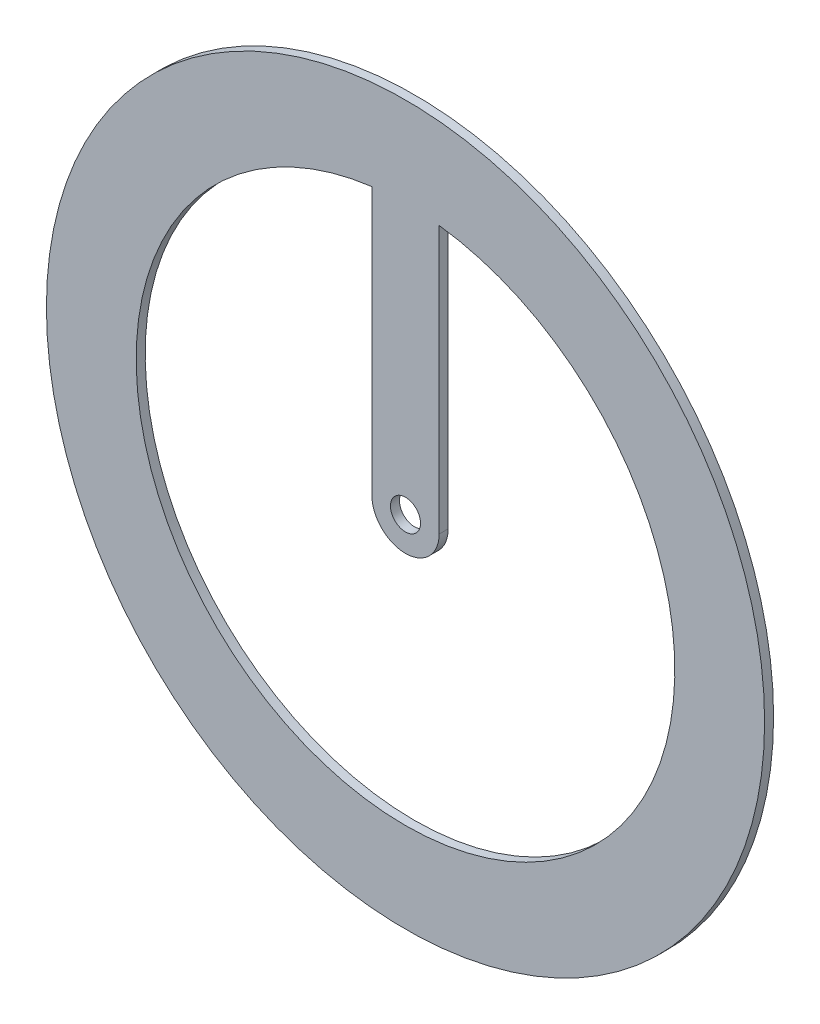
ISO-10303-21;
HEADER;
FILE_DESCRIPTION(('STEP AP214'),'2;1');
FILE_NAME('part.step','',(''),(''),'','','');
FILE_SCHEMA(('AUTOMOTIVE_DESIGN { 1 0 10303 214 1 1 1 1 }'));
ENDSEC;
DATA;
#1=APPLICATION_CONTEXT('core data for automotive mechanical design processes');
#2=APPLICATION_PROTOCOL_DEFINITION('international standard','automotive_design',2000,#1);
#3=PRODUCT_CONTEXT('',#1,'mechanical');
#4=PRODUCT('Part','Part','',(#3));
#5=PRODUCT_RELATED_PRODUCT_CATEGORY('part','',(#4));
#6=PRODUCT_DEFINITION_FORMATION('','',#4);
#7=PRODUCT_DEFINITION_CONTEXT('part definition',#1,'design');
#8=PRODUCT_DEFINITION('design','',#6,#7);
#9=PRODUCT_DEFINITION_SHAPE('','',#8);
#10=(LENGTH_UNIT() NAMED_UNIT(*) SI_UNIT(.MILLI.,.METRE.));
#11=(NAMED_UNIT(*) PLANE_ANGLE_UNIT() SI_UNIT($,.RADIAN.));
#12=(NAMED_UNIT(*) SI_UNIT($,.STERADIAN.) SOLID_ANGLE_UNIT());
#13=UNCERTAINTY_MEASURE_WITH_UNIT(LENGTH_MEASURE(1.E-05),#10,'distance_accuracy_value','');
#14=(GEOMETRIC_REPRESENTATION_CONTEXT(3) GLOBAL_UNCERTAINTY_ASSIGNED_CONTEXT((#13)) GLOBAL_UNIT_ASSIGNED_CONTEXT((#10,
#11,#12)) REPRESENTATION_CONTEXT('',''));
#15=CARTESIAN_POINT('',(0.,0.,0.));
#16=DIRECTION('',(0.,0.,1.));
#17=DIRECTION('',(1.,0.,0.));
#18=AXIS2_PLACEMENT_3D('',#15,#16,#17);
#19=CARTESIAN_POINT('',(0.,0.,2.54));
#20=DIRECTION('',(0.,0.,1.));
#21=DIRECTION('',(1.,0.,0.));
#22=AXIS2_PLACEMENT_3D('',#19,#20,#21);
#23=PLANE('',#22);
#24=CARTESIAN_POINT('',(0.,0.,2.54));
#25=DIRECTION('',(0.,0.,1.));
#26=DIRECTION('',(1.,0.,0.));
#27=AXIS2_PLACEMENT_3D('',#24,#25,#26);
#28=CIRCLE('',#27,101.6);
#29=CARTESIAN_POINT('',(101.6,0.,2.54));
#30=VERTEX_POINT('',#29);
#31=EDGE_CURVE('E11',#30,#30,#28,.T.);
#32=ORIENTED_EDGE('',*,*,#31,.T.);
#33=EDGE_LOOP('',(#32));
#34=FACE_BOUND('',#33,.T.);
#35=CARTESIAN_POINT('',(0.,0.,2.54));
#36=DIRECTION('',(0.,0.,1.));
#37=DIRECTION('',(1.,0.,0.));
#38=AXIS2_PLACEMENT_3D('',#35,#36,#37);
#39=CIRCLE('',#38,4.24957387007158);
#40=CARTESIAN_POINT('',(4.24957387007158,0.,2.54));
#41=VERTEX_POINT('',#40);
#42=EDGE_CURVE('E129',#41,#41,#39,.T.);
#43=ORIENTED_EDGE('',*,*,#42,.F.);
#44=EDGE_LOOP('',(#43));
#45=FACE_BOUND('',#44,.T.);
#46=DIRECTION('',(0.,1.,0.));
#47=VECTOR('',#46,1.);
#48=CARTESIAN_POINT('',(-9.525,0.,2.54));
#49=LINE('',#48,#47);
#50=CARTESIAN_POINT('',(-9.525,0.,2.54));
#51=VERTEX_POINT('',#50);
#52=CARTESIAN_POINT('',(-9.525,75.6023437136707,2.54));
#53=VERTEX_POINT('',#52);
#54=EDGE_CURVE('E90',#51,#53,#49,.T.);
#55=ORIENTED_EDGE('',*,*,#54,.F.);
#56=CARTESIAN_POINT('',(0.,0.,2.54));
#57=DIRECTION('',(0.,0.,-1.));
#58=DIRECTION('',(1.,0.,0.));
#59=AXIS2_PLACEMENT_3D('',#56,#57,#58);
#60=CIRCLE('',#59,9.525);
#61=CARTESIAN_POINT('',(9.525,0.,2.54));
#62=VERTEX_POINT('',#61);
#63=EDGE_CURVE('E81',#62,#51,#60,.T.);
#64=ORIENTED_EDGE('',*,*,#63,.F.);
#65=DIRECTION('',(0.,-1.,0.));
#66=VECTOR('',#65,1.);
#67=CARTESIAN_POINT('',(9.525,0.,2.54));
#68=LINE('',#67,#66);
#69=CARTESIAN_POINT('',(9.525,75.6023437136707,2.54));
#70=VERTEX_POINT('',#69);
#71=EDGE_CURVE('E107',#70,#62,#68,.T.);
#72=ORIENTED_EDGE('',*,*,#71,.F.);
#73=CARTESIAN_POINT('',(0.,0.,2.54));
#74=DIRECTION('',(0.,0.,1.));
#75=DIRECTION('',(1.,0.,0.));
#76=AXIS2_PLACEMENT_3D('',#73,#74,#75);
#77=CIRCLE('',#76,76.2);
#78=EDGE_CURVE('E103',#53,#70,#77,.T.);
#79=ORIENTED_EDGE('',*,*,#78,.F.);
#80=EDGE_LOOP('',(#55,#64,#72,#79));
#81=FACE_BOUND('',#80,.T.);
#82=ADVANCED_FACE('F39',(#34,#45,#81),#23,.T.);
#83=CARTESIAN_POINT('',(0.,0.,0.));
#84=DIRECTION('',(0.,0.,1.));
#85=DIRECTION('',(1.,0.,0.));
#86=AXIS2_PLACEMENT_3D('',#83,#84,#85);
#87=PLANE('',#86);
#88=CARTESIAN_POINT('',(0.,0.,0.));
#89=DIRECTION('',(0.,0.,1.));
#90=DIRECTION('',(1.,0.,0.));
#91=AXIS2_PLACEMENT_3D('',#88,#89,#90);
#92=CIRCLE('',#91,4.24957387007158);
#93=CARTESIAN_POINT('',(4.24957387007158,0.,0.));
#94=VERTEX_POINT('',#93);
#95=EDGE_CURVE('E99',#94,#94,#92,.T.);
#96=ORIENTED_EDGE('',*,*,#95,.T.);
#97=EDGE_LOOP('',(#96));
#98=FACE_BOUND('',#97,.T.);
#99=CARTESIAN_POINT('',(0.,0.,0.));
#100=DIRECTION('',(0.,0.,1.));
#101=DIRECTION('',(1.,0.,0.));
#102=AXIS2_PLACEMENT_3D('',#99,#100,#101);
#103=CIRCLE('',#102,101.6);
#104=CARTESIAN_POINT('',(101.6,0.,0.));
#105=VERTEX_POINT('',#104);
#106=EDGE_CURVE('E43',#105,#105,#103,.T.);
#107=ORIENTED_EDGE('',*,*,#106,.F.);
#108=EDGE_LOOP('',(#107));
#109=FACE_BOUND('',#108,.T.);
#110=CARTESIAN_POINT('',(0.,0.,0.));
#111=DIRECTION('',(0.,0.,-1.));
#112=DIRECTION('',(1.,0.,0.));
#113=AXIS2_PLACEMENT_3D('',#110,#111,#112);
#114=CIRCLE('',#113,9.525);
#115=CARTESIAN_POINT('',(9.525,0.,0.));
#116=VERTEX_POINT('',#115);
#117=CARTESIAN_POINT('',(-9.525,0.,0.));
#118=VERTEX_POINT('',#117);
#119=EDGE_CURVE('E63',#116,#118,#114,.T.);
#120=ORIENTED_EDGE('',*,*,#119,.T.);
#121=DIRECTION('',(0.,1.,0.));
#122=VECTOR('',#121,1.);
#123=CARTESIAN_POINT('',(-9.525,0.,0.));
#124=LINE('',#123,#122);
#125=CARTESIAN_POINT('',(-9.525,75.6023437136707,0.));
#126=VERTEX_POINT('',#125);
#127=EDGE_CURVE('E97',#118,#126,#124,.T.);
#128=ORIENTED_EDGE('',*,*,#127,.T.);
#129=CARTESIAN_POINT('',(0.,0.,0.));
#130=DIRECTION('',(0.,0.,1.));
#131=DIRECTION('',(1.,0.,0.));
#132=AXIS2_PLACEMENT_3D('',#129,#130,#131);
#133=CIRCLE('',#132,76.2);
#134=CARTESIAN_POINT('',(9.52500000000001,75.6023437136707,0.));
#135=VERTEX_POINT('',#134);
#136=EDGE_CURVE('E116',#126,#135,#133,.T.);
#137=ORIENTED_EDGE('',*,*,#136,.T.);
#138=DIRECTION('',(0.,-1.,0.));
#139=VECTOR('',#138,1.);
#140=CARTESIAN_POINT('',(9.525,0.,0.));
#141=LINE('',#140,#139);
#142=EDGE_CURVE('E91',#135,#116,#141,.T.);
#143=ORIENTED_EDGE('',*,*,#142,.T.);
#144=EDGE_LOOP('',(#120,#128,#137,#143));
#145=FACE_BOUND('',#144,.T.);
#146=ADVANCED_FACE('F137',(#98,#109,#145),#87,.F.);
#147=CARTESIAN_POINT('',(0.,0.,2.54));
#148=DIRECTION('',(0.,0.,-1.));
#149=DIRECTION('',(-1.,0.,0.));
#150=AXIS2_PLACEMENT_3D('',#147,#148,#149);
#151=CYLINDRICAL_SURFACE('',#150,101.6);
#152=ORIENTED_EDGE('',*,*,#31,.F.);
#153=EDGE_LOOP('',(#152));
#154=FACE_BOUND('',#153,.T.);
#155=ORIENTED_EDGE('',*,*,#106,.T.);
#156=EDGE_LOOP('',(#155));
#157=FACE_BOUND('',#156,.T.);
#158=ADVANCED_FACE('F41',(#154,#157),#151,.T.);
#159=CARTESIAN_POINT('',(0.,0.,2.54));
#160=DIRECTION('',(0.,0.,-1.));
#161=DIRECTION('',(-1.,0.,0.));
#162=AXIS2_PLACEMENT_3D('',#159,#160,#161);
#163=CYLINDRICAL_SURFACE('',#162,4.24957387007158);
#164=ORIENTED_EDGE('',*,*,#42,.T.);
#165=EDGE_LOOP('',(#164));
#166=FACE_BOUND('',#165,.T.);
#167=ORIENTED_EDGE('',*,*,#95,.F.);
#168=EDGE_LOOP('',(#167));
#169=FACE_BOUND('',#168,.T.);
#170=ADVANCED_FACE('F140',(#166,#169),#163,.F.);
#171=CARTESIAN_POINT('',(0.,0.,2.54));
#172=DIRECTION('',(0.,0.,-1.));
#173=DIRECTION('',(-1.,0.,0.));
#174=AXIS2_PLACEMENT_3D('',#171,#172,#173);
#175=CYLINDRICAL_SURFACE('',#174,9.525);
#176=ORIENTED_EDGE('',*,*,#119,.F.);
#177=DIRECTION('',(0.,0.,-1.));
#178=VECTOR('',#177,1.);
#179=CARTESIAN_POINT('',(9.525,0.,2.54));
#180=LINE('',#179,#178);
#181=EDGE_CURVE('E85',#62,#116,#180,.T.);
#182=ORIENTED_EDGE('',*,*,#181,.F.);
#183=ORIENTED_EDGE('',*,*,#63,.T.);
#184=DIRECTION('',(0.,0.,-1.));
#185=VECTOR('',#184,1.);
#186=CARTESIAN_POINT('',(-9.525,0.,2.54));
#187=LINE('',#186,#185);
#188=EDGE_CURVE('E84',#51,#118,#187,.T.);
#189=ORIENTED_EDGE('',*,*,#188,.T.);
#190=EDGE_LOOP('',(#176,#182,#183,#189));
#191=FACE_BOUND('',#190,.T.);
#192=ADVANCED_FACE('F83',(#191),#175,.T.);
#193=CARTESIAN_POINT('',(-9.525,0.,2.54));
#194=DIRECTION('',(-1.,0.,0.));
#195=DIRECTION('',(0.,0.,1.));
#196=AXIS2_PLACEMENT_3D('',#193,#194,#195);
#197=PLANE('',#196);
#198=ORIENTED_EDGE('',*,*,#127,.F.);
#199=ORIENTED_EDGE('',*,*,#188,.F.);
#200=ORIENTED_EDGE('',*,*,#54,.T.);
#201=DIRECTION('',(0.,0.,-1.));
#202=VECTOR('',#201,1.);
#203=CARTESIAN_POINT('',(-9.525,75.6023437136707,2.54));
#204=LINE('',#203,#202);
#205=EDGE_CURVE('E100',#53,#126,#204,.T.);
#206=ORIENTED_EDGE('',*,*,#205,.T.);
#207=EDGE_LOOP('',(#198,#199,#200,#206));
#208=FACE_BOUND('',#207,.T.);
#209=ADVANCED_FACE('F94',(#208),#197,.T.);
#210=CARTESIAN_POINT('',(0.,0.,2.54));
#211=DIRECTION('',(0.,0.,-1.));
#212=DIRECTION('',(-1.,0.,0.));
#213=AXIS2_PLACEMENT_3D('',#210,#211,#212);
#214=CYLINDRICAL_SURFACE('',#213,76.2);
#215=ORIENTED_EDGE('',*,*,#136,.F.);
#216=ORIENTED_EDGE('',*,*,#205,.F.);
#217=ORIENTED_EDGE('',*,*,#78,.T.);
#218=DIRECTION('',(0.,0.,-1.));
#219=VECTOR('',#218,1.);
#220=CARTESIAN_POINT('',(9.52500000000001,75.6023437136707,2.54));
#221=LINE('',#220,#219);
#222=EDGE_CURVE('E55',#70,#135,#221,.T.);
#223=ORIENTED_EDGE('',*,*,#222,.T.);
#224=EDGE_LOOP('',(#215,#216,#217,#223));
#225=FACE_BOUND('',#224,.T.);
#226=ADVANCED_FACE('F167',(#225),#214,.F.);
#227=CARTESIAN_POINT('',(9.525,0.,2.54));
#228=DIRECTION('',(1.,0.,0.));
#229=DIRECTION('',(0.,0.,-1.));
#230=AXIS2_PLACEMENT_3D('',#227,#228,#229);
#231=PLANE('',#230);
#232=ORIENTED_EDGE('',*,*,#142,.F.);
#233=ORIENTED_EDGE('',*,*,#222,.F.);
#234=ORIENTED_EDGE('',*,*,#71,.T.);
#235=ORIENTED_EDGE('',*,*,#181,.T.);
#236=EDGE_LOOP('',(#232,#233,#234,#235));
#237=FACE_BOUND('',#236,.T.);
#238=ADVANCED_FACE('F165',(#237),#231,.T.);
#239=CLOSED_SHELL('',(#82,#146,#158,#170,#192,#209,#226,#238));
#240=MANIFOLD_SOLID_BREP('B2',#239);
#241=ADVANCED_BREP_SHAPE_REPRESENTATION('',(#18,#240),#14);
#242=SHAPE_DEFINITION_REPRESENTATION(#9,#241);
ENDSEC;
END-ISO-10303-21;
